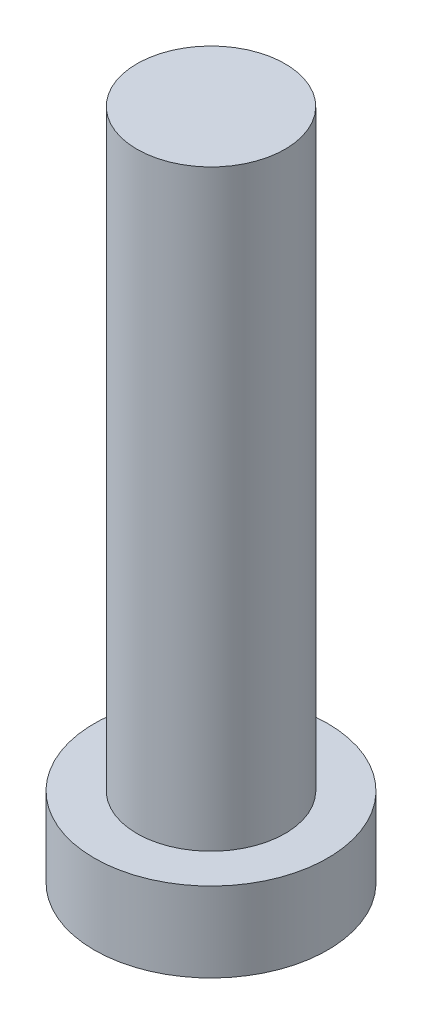
ISO-10303-21;
HEADER;
FILE_DESCRIPTION(('STEP AP214'),'2;1');
FILE_NAME('part.step','',(''),(''),'','','');
FILE_SCHEMA(('AUTOMOTIVE_DESIGN { 1 0 10303 214 1 1 1 1 }'));
ENDSEC;
DATA;
#1=APPLICATION_CONTEXT('core data for automotive mechanical design processes');
#2=APPLICATION_PROTOCOL_DEFINITION('international standard','automotive_design',2000,#1);
#3=PRODUCT_CONTEXT('',#1,'mechanical');
#4=PRODUCT('Part','Part','',(#3));
#5=PRODUCT_RELATED_PRODUCT_CATEGORY('part','',(#4));
#6=PRODUCT_DEFINITION_FORMATION('','',#4);
#7=PRODUCT_DEFINITION_CONTEXT('part definition',#1,'design');
#8=PRODUCT_DEFINITION('design','',#6,#7);
#9=PRODUCT_DEFINITION_SHAPE('','',#8);
#10=(LENGTH_UNIT() NAMED_UNIT(*) SI_UNIT(.MILLI.,.METRE.));
#11=(NAMED_UNIT(*) PLANE_ANGLE_UNIT() SI_UNIT($,.RADIAN.));
#12=(NAMED_UNIT(*) SI_UNIT($,.STERADIAN.) SOLID_ANGLE_UNIT());
#13=UNCERTAINTY_MEASURE_WITH_UNIT(LENGTH_MEASURE(1.E-05),#10,'distance_accuracy_value','');
#14=(GEOMETRIC_REPRESENTATION_CONTEXT(3) GLOBAL_UNCERTAINTY_ASSIGNED_CONTEXT((#13)) GLOBAL_UNIT_ASSIGNED_CONTEXT((#10,
#11,#12)) REPRESENTATION_CONTEXT('',''));
#15=CARTESIAN_POINT('',(0.,0.,0.));
#16=DIRECTION('',(0.,0.,1.));
#17=DIRECTION('',(1.,0.,0.));
#18=AXIS2_PLACEMENT_3D('',#15,#16,#17);
#19=CARTESIAN_POINT('',(0.,0.,0.));
#20=DIRECTION('',(0.,1.,0.));
#21=DIRECTION('',(0.,0.,1.));
#22=AXIS2_PLACEMENT_3D('',#19,#20,#21);
#23=PLANE('',#22);
#24=CARTESIAN_POINT('',(0.,0.,0.));
#25=DIRECTION('',(0.,1.,0.));
#26=DIRECTION('',(0.,0.,1.));
#27=AXIS2_PLACEMENT_3D('',#24,#25,#26);
#28=CIRCLE('',#27,3.15);
#29=CARTESIAN_POINT('',(0.,0.,3.15));
#30=VERTEX_POINT('',#29);
#31=EDGE_CURVE('E39',#30,#30,#28,.T.);
#32=ORIENTED_EDGE('',*,*,#31,.F.);
#33=EDGE_LOOP('',(#32));
#34=FACE_BOUND('',#33,.T.);
#35=CARTESIAN_POINT('',(1.,0.,1.));
#36=DIRECTION('',(0.,1.,0.));
#37=DIRECTION('',(0.,0.,-1.));
#38=AXIS2_PLACEMENT_3D('',#35,#36,#37);
#39=CIRCLE('',#38,0.5);
#40=CARTESIAN_POINT('',(1.,0.,0.5));
#41=VERTEX_POINT('',#40);
#42=CARTESIAN_POINT('',(0.5,0.,1.));
#43=VERTEX_POINT('',#42);
#44=EDGE_CURVE('E186',#41,#43,#39,.T.);
#45=ORIENTED_EDGE('',*,*,#44,.F.);
#46=DIRECTION('',(-1.,0.,0.));
#47=VECTOR('',#46,1.);
#48=CARTESIAN_POINT('',(1.,0.,0.5));
#49=LINE('',#48,#47);
#50=CARTESIAN_POINT('',(2.,0.,0.5));
#51=VERTEX_POINT('',#50);
#52=EDGE_CURVE('E52',#51,#41,#49,.T.);
#53=ORIENTED_EDGE('',*,*,#52,.F.);
#54=DIRECTION('',(0.,0.,1.));
#55=VECTOR('',#54,1.);
#56=CARTESIAN_POINT('',(2.,0.,-0.5));
#57=LINE('',#56,#55);
#58=CARTESIAN_POINT('',(2.,0.,-0.5));
#59=VERTEX_POINT('',#58);
#60=EDGE_CURVE('E225',#59,#51,#57,.T.);
#61=ORIENTED_EDGE('',*,*,#60,.F.);
#62=DIRECTION('',(1.,0.,0.));
#63=VECTOR('',#62,1.);
#64=CARTESIAN_POINT('',(1.,0.,-0.5));
#65=LINE('',#64,#63);
#66=CARTESIAN_POINT('',(1.,0.,-0.5));
#67=VERTEX_POINT('',#66);
#68=EDGE_CURVE('E223',#67,#59,#65,.T.);
#69=ORIENTED_EDGE('',*,*,#68,.F.);
#70=CARTESIAN_POINT('',(1.,0.,-1.));
#71=DIRECTION('',(0.,1.,0.));
#72=DIRECTION('',(0.,0.,-1.));
#73=AXIS2_PLACEMENT_3D('',#70,#71,#72);
#74=CIRCLE('',#73,0.5);
#75=CARTESIAN_POINT('',(0.500000000000001,0.,-1.));
#76=VERTEX_POINT('',#75);
#77=EDGE_CURVE('E160',#76,#67,#74,.T.);
#78=ORIENTED_EDGE('',*,*,#77,.F.);
#79=DIRECTION('',(0.,0.,1.));
#80=VECTOR('',#79,1.);
#81=CARTESIAN_POINT('',(0.500000000000001,0.,-2.));
#82=LINE('',#81,#80);
#83=CARTESIAN_POINT('',(0.500000000000001,0.,-2.));
#84=VERTEX_POINT('',#83);
#85=EDGE_CURVE('E219',#84,#76,#82,.T.);
#86=ORIENTED_EDGE('',*,*,#85,.F.);
#87=DIRECTION('',(1.,0.,0.));
#88=VECTOR('',#87,1.);
#89=CARTESIAN_POINT('',(-0.5,0.,-2.));
#90=LINE('',#89,#88);
#91=CARTESIAN_POINT('',(-0.5,0.,-2.));
#92=VERTEX_POINT('',#91);
#93=EDGE_CURVE('E216',#92,#84,#90,.T.);
#94=ORIENTED_EDGE('',*,*,#93,.F.);
#95=DIRECTION('',(0.,0.,-1.));
#96=VECTOR('',#95,1.);
#97=CARTESIAN_POINT('',(-0.5,0.,-2.));
#98=LINE('',#97,#96);
#99=CARTESIAN_POINT('',(-0.5,0.,-1.));
#100=VERTEX_POINT('',#99);
#101=EDGE_CURVE('E213',#100,#92,#98,.T.);
#102=ORIENTED_EDGE('',*,*,#101,.F.);
#103=CARTESIAN_POINT('',(-1.,0.,-1.));
#104=DIRECTION('',(0.,1.,0.));
#105=DIRECTION('',(0.,0.,-1.));
#106=AXIS2_PLACEMENT_3D('',#103,#104,#105);
#107=CIRCLE('',#106,0.5);
#108=CARTESIAN_POINT('',(-1.,0.,-0.5));
#109=VERTEX_POINT('',#108);
#110=EDGE_CURVE('E210',#109,#100,#107,.T.);
#111=ORIENTED_EDGE('',*,*,#110,.F.);
#112=DIRECTION('',(1.,0.,0.));
#113=VECTOR('',#112,1.);
#114=CARTESIAN_POINT('',(-2.,0.,-0.5));
#115=LINE('',#114,#113);
#116=CARTESIAN_POINT('',(-2.,0.,-0.5));
#117=VERTEX_POINT('',#116);
#118=EDGE_CURVE('E207',#117,#109,#115,.T.);
#119=ORIENTED_EDGE('',*,*,#118,.F.);
#120=DIRECTION('',(0.,0.,-1.));
#121=VECTOR('',#120,1.);
#122=CARTESIAN_POINT('',(-2.,0.,-0.5));
#123=LINE('',#122,#121);
#124=CARTESIAN_POINT('',(-2.,0.,0.5));
#125=VERTEX_POINT('',#124);
#126=EDGE_CURVE('E204',#125,#117,#123,.T.);
#127=ORIENTED_EDGE('',*,*,#126,.F.);
#128=DIRECTION('',(-1.,0.,0.));
#129=VECTOR('',#128,1.);
#130=CARTESIAN_POINT('',(-2.,0.,0.5));
#131=LINE('',#130,#129);
#132=CARTESIAN_POINT('',(-1.,0.,0.5));
#133=VERTEX_POINT('',#132);
#134=EDGE_CURVE('E201',#133,#125,#131,.T.);
#135=ORIENTED_EDGE('',*,*,#134,.F.);
#136=CARTESIAN_POINT('',(-1.,0.,1.));
#137=DIRECTION('',(0.,1.,0.));
#138=DIRECTION('',(0.,0.,1.));
#139=AXIS2_PLACEMENT_3D('',#136,#137,#138);
#140=CIRCLE('',#139,0.5);
#141=CARTESIAN_POINT('',(-0.5,0.,1.));
#142=VERTEX_POINT('',#141);
#143=EDGE_CURVE('E198',#142,#133,#140,.T.);
#144=ORIENTED_EDGE('',*,*,#143,.F.);
#145=DIRECTION('',(0.,0.,-1.));
#146=VECTOR('',#145,1.);
#147=CARTESIAN_POINT('',(-0.5,0.,1.));
#148=LINE('',#147,#146);
#149=CARTESIAN_POINT('',(-0.5,0.,2.));
#150=VERTEX_POINT('',#149);
#151=EDGE_CURVE('E195',#150,#142,#148,.T.);
#152=ORIENTED_EDGE('',*,*,#151,.F.);
#153=DIRECTION('',(-1.,0.,0.));
#154=VECTOR('',#153,1.);
#155=CARTESIAN_POINT('',(-0.5,0.,2.));
#156=LINE('',#155,#154);
#157=CARTESIAN_POINT('',(0.500000000000001,0.,2.));
#158=VERTEX_POINT('',#157);
#159=EDGE_CURVE('E192',#158,#150,#156,.T.);
#160=ORIENTED_EDGE('',*,*,#159,.F.);
#161=DIRECTION('',(0.,0.,1.));
#162=VECTOR('',#161,1.);
#163=CARTESIAN_POINT('',(0.5,0.,1.));
#164=LINE('',#163,#162);
#165=EDGE_CURVE('E189',#43,#158,#164,.T.);
#166=ORIENTED_EDGE('',*,*,#165,.F.);
#167=EDGE_LOOP('',(#45,#53,#61,#69,#78,#86,#94,#102,#111,#119,#127,#135,#144,#152,#160,#166));
#168=FACE_BOUND('',#167,.T.);
#169=ADVANCED_FACE('F35',(#34,#168),#23,.F.);
#170=CARTESIAN_POINT('',(0.,2.15,0.));
#171=DIRECTION('',(0.,-1.,0.));
#172=DIRECTION('',(0.,0.,-1.));
#173=AXIS2_PLACEMENT_3D('',#170,#171,#172);
#174=CYLINDRICAL_SURFACE('',#173,3.15);
#175=CARTESIAN_POINT('',(0.,2.15,0.));
#176=DIRECTION('',(0.,1.,0.));
#177=DIRECTION('',(0.,0.,1.));
#178=AXIS2_PLACEMENT_3D('',#175,#176,#177);
#179=CIRCLE('',#178,3.15);
#180=CARTESIAN_POINT('',(0.,2.15,3.15));
#181=VERTEX_POINT('',#180);
#182=EDGE_CURVE('E44',#181,#181,#179,.T.);
#183=ORIENTED_EDGE('',*,*,#182,.F.);
#184=EDGE_LOOP('',(#183));
#185=FACE_BOUND('',#184,.T.);
#186=ORIENTED_EDGE('',*,*,#31,.T.);
#187=EDGE_LOOP('',(#186));
#188=FACE_BOUND('',#187,.T.);
#189=ADVANCED_FACE('F37',(#185,#188),#174,.T.);
#190=CARTESIAN_POINT('',(0.,2.15,0.));
#191=DIRECTION('',(0.,1.,0.));
#192=DIRECTION('',(0.,0.,1.));
#193=AXIS2_PLACEMENT_3D('',#190,#191,#192);
#194=PLANE('',#193);
#195=CARTESIAN_POINT('',(0.,2.15,0.));
#196=DIRECTION('',(0.,1.,0.));
#197=DIRECTION('',(0.,0.,1.));
#198=AXIS2_PLACEMENT_3D('',#195,#196,#197);
#199=CIRCLE('',#198,2.);
#200=CARTESIAN_POINT('',(0.,2.15,2.));
#201=VERTEX_POINT('',#200);
#202=EDGE_CURVE('E11',#201,#201,#199,.T.);
#203=ORIENTED_EDGE('',*,*,#202,.F.);
#204=EDGE_LOOP('',(#203));
#205=FACE_BOUND('',#204,.T.);
#206=ORIENTED_EDGE('',*,*,#182,.T.);
#207=EDGE_LOOP('',(#206));
#208=FACE_BOUND('',#207,.T.);
#209=ADVANCED_FACE('F374',(#205,#208),#194,.T.);
#210=CARTESIAN_POINT('',(0.,18.15,0.));
#211=DIRECTION('',(0.,-1.,0.));
#212=DIRECTION('',(0.,0.,-1.));
#213=AXIS2_PLACEMENT_3D('',#210,#211,#212);
#214=CYLINDRICAL_SURFACE('',#213,2.);
#215=CARTESIAN_POINT('',(0.,18.15,0.));
#216=DIRECTION('',(0.,1.,0.));
#217=DIRECTION('',(0.,0.,1.));
#218=AXIS2_PLACEMENT_3D('',#215,#216,#217);
#219=CIRCLE('',#218,2.);
#220=CARTESIAN_POINT('',(0.,18.15,2.));
#221=VERTEX_POINT('',#220);
#222=EDGE_CURVE('E229',#221,#221,#219,.T.);
#223=ORIENTED_EDGE('',*,*,#222,.F.);
#224=EDGE_LOOP('',(#223));
#225=FACE_BOUND('',#224,.T.);
#226=ORIENTED_EDGE('',*,*,#202,.T.);
#227=EDGE_LOOP('',(#226));
#228=FACE_BOUND('',#227,.T.);
#229=ADVANCED_FACE('F370',(#225,#228),#214,.T.);
#230=CARTESIAN_POINT('',(0.,18.15,0.));
#231=DIRECTION('',(0.,1.,0.));
#232=DIRECTION('',(0.,0.,1.));
#233=AXIS2_PLACEMENT_3D('',#230,#231,#232);
#234=PLANE('',#233);
#235=ORIENTED_EDGE('',*,*,#222,.T.);
#236=EDGE_LOOP('',(#235));
#237=FACE_BOUND('',#236,.T.);
#238=ADVANCED_FACE('F320',(#237),#234,.T.);
#239=CARTESIAN_POINT('',(1.,1.5,0.5));
#240=DIRECTION('',(0.,0.,1.));
#241=DIRECTION('',(1.,0.,0.));
#242=AXIS2_PLACEMENT_3D('',#239,#240,#241);
#243=PLANE('',#242);
#244=ORIENTED_EDGE('',*,*,#52,.T.);
#245=DIRECTION('',(0.,-1.,0.));
#246=VECTOR('',#245,1.);
#247=CARTESIAN_POINT('',(1.,1.5,0.5));
#248=LINE('',#247,#246);
#249=CARTESIAN_POINT('',(1.,1.5,0.5));
#250=VERTEX_POINT('',#249);
#251=EDGE_CURVE('E112',#250,#41,#248,.T.);
#252=ORIENTED_EDGE('',*,*,#251,.F.);
#253=DIRECTION('',(-1.,0.,0.));
#254=VECTOR('',#253,1.);
#255=CARTESIAN_POINT('',(1.,1.5,0.5));
#256=LINE('',#255,#254);
#257=CARTESIAN_POINT('',(2.,1.5,0.5));
#258=VERTEX_POINT('',#257);
#259=EDGE_CURVE('E227',#258,#250,#256,.T.);
#260=ORIENTED_EDGE('',*,*,#259,.F.);
#261=DIRECTION('',(0.,-1.,0.));
#262=VECTOR('',#261,1.);
#263=CARTESIAN_POINT('',(2.,1.5,0.5));
#264=LINE('',#263,#262);
#265=EDGE_CURVE('E60',#258,#51,#264,.T.);
#266=ORIENTED_EDGE('',*,*,#265,.T.);
#267=EDGE_LOOP('',(#244,#252,#260,#266));
#268=FACE_BOUND('',#267,.T.);
#269=ADVANCED_FACE('F313',(#268),#243,.F.);
#270=CARTESIAN_POINT('',(2.,1.5,-0.5));
#271=DIRECTION('',(1.,0.,0.));
#272=DIRECTION('',(0.,0.,-1.));
#273=AXIS2_PLACEMENT_3D('',#270,#271,#272);
#274=PLANE('',#273);
#275=ORIENTED_EDGE('',*,*,#60,.T.);
#276=ORIENTED_EDGE('',*,*,#265,.F.);
#277=DIRECTION('',(0.,0.,1.));
#278=VECTOR('',#277,1.);
#279=CARTESIAN_POINT('',(2.,1.5,-0.5));
#280=LINE('',#279,#278);
#281=CARTESIAN_POINT('',(2.,1.5,-0.5));
#282=VERTEX_POINT('',#281);
#283=EDGE_CURVE('E172',#282,#258,#280,.T.);
#284=ORIENTED_EDGE('',*,*,#283,.F.);
#285=DIRECTION('',(0.,-1.,0.));
#286=VECTOR('',#285,1.);
#287=CARTESIAN_POINT('',(2.,1.5,-0.5));
#288=LINE('',#287,#286);
#289=EDGE_CURVE('E164',#282,#59,#288,.T.);
#290=ORIENTED_EDGE('',*,*,#289,.T.);
#291=EDGE_LOOP('',(#275,#276,#284,#290));
#292=FACE_BOUND('',#291,.T.);
#293=ADVANCED_FACE('F311',(#292),#274,.F.);
#294=CARTESIAN_POINT('',(1.,1.5,-0.5));
#295=DIRECTION('',(0.,0.,-1.));
#296=DIRECTION('',(-1.,0.,0.));
#297=AXIS2_PLACEMENT_3D('',#294,#295,#296);
#298=PLANE('',#297);
#299=ORIENTED_EDGE('',*,*,#68,.T.);
#300=ORIENTED_EDGE('',*,*,#289,.F.);
#301=DIRECTION('',(1.,0.,0.));
#302=VECTOR('',#301,1.);
#303=CARTESIAN_POINT('',(1.,1.5,-0.5));
#304=LINE('',#303,#302);
#305=CARTESIAN_POINT('',(1.,1.5,-0.5));
#306=VERTEX_POINT('',#305);
#307=EDGE_CURVE('E168',#306,#282,#304,.T.);
#308=ORIENTED_EDGE('',*,*,#307,.F.);
#309=DIRECTION('',(0.,-1.,0.));
#310=VECTOR('',#309,1.);
#311=CARTESIAN_POINT('',(1.,1.5,-0.5));
#312=LINE('',#311,#310);
#313=EDGE_CURVE('E153',#306,#67,#312,.T.);
#314=ORIENTED_EDGE('',*,*,#313,.T.);
#315=EDGE_LOOP('',(#299,#300,#308,#314));
#316=FACE_BOUND('',#315,.T.);
#317=ADVANCED_FACE('F169',(#316),#298,.F.);
#318=CARTESIAN_POINT('',(1.,1.5,-1.));
#319=DIRECTION('',(0.,-1.,0.));
#320=DIRECTION('',(0.,0.,-1.));
#321=AXIS2_PLACEMENT_3D('',#318,#319,#320);
#322=CYLINDRICAL_SURFACE('',#321,0.5);
#323=ORIENTED_EDGE('',*,*,#77,.T.);
#324=ORIENTED_EDGE('',*,*,#313,.F.);
#325=CARTESIAN_POINT('',(1.,1.5,-1.));
#326=DIRECTION('',(0.,1.,0.));
#327=DIRECTION('',(0.,0.,-1.));
#328=AXIS2_PLACEMENT_3D('',#325,#326,#327);
#329=CIRCLE('',#328,0.5);
#330=CARTESIAN_POINT('',(0.500000000000001,1.5,-1.));
#331=VERTEX_POINT('',#330);
#332=EDGE_CURVE('E157',#331,#306,#329,.T.);
#333=ORIENTED_EDGE('',*,*,#332,.F.);
#334=DIRECTION('',(0.,-1.,0.));
#335=VECTOR('',#334,1.);
#336=CARTESIAN_POINT('',(0.500000000000001,1.5,-1.));
#337=LINE('',#336,#335);
#338=EDGE_CURVE('E165',#331,#76,#337,.T.);
#339=ORIENTED_EDGE('',*,*,#338,.T.);
#340=EDGE_LOOP('',(#323,#324,#333,#339));
#341=FACE_BOUND('',#340,.T.);
#342=ADVANCED_FACE('F155',(#341),#322,.T.);
#343=CARTESIAN_POINT('',(0.500000000000001,1.5,-2.));
#344=DIRECTION('',(1.,0.,0.));
#345=DIRECTION('',(0.,0.,-1.));
#346=AXIS2_PLACEMENT_3D('',#343,#344,#345);
#347=PLANE('',#346);
#348=ORIENTED_EDGE('',*,*,#85,.T.);
#349=ORIENTED_EDGE('',*,*,#338,.F.);
#350=DIRECTION('',(0.,0.,1.));
#351=VECTOR('',#350,1.);
#352=CARTESIAN_POINT('',(0.500000000000001,1.5,-2.));
#353=LINE('',#352,#351);
#354=CARTESIAN_POINT('',(0.500000000000001,1.5,-2.));
#355=VERTEX_POINT('',#354);
#356=EDGE_CURVE('E178',#355,#331,#353,.T.);
#357=ORIENTED_EDGE('',*,*,#356,.F.);
#358=DIRECTION('',(0.,-1.,0.));
#359=VECTOR('',#358,1.);
#360=CARTESIAN_POINT('',(0.500000000000001,1.5,-2.));
#361=LINE('',#360,#359);
#362=EDGE_CURVE('E232',#355,#84,#361,.T.);
#363=ORIENTED_EDGE('',*,*,#362,.T.);
#364=EDGE_LOOP('',(#348,#349,#357,#363));
#365=FACE_BOUND('',#364,.T.);
#366=ADVANCED_FACE('F310',(#365),#347,.F.);
#367=CARTESIAN_POINT('',(-0.5,1.5,-2.));
#368=DIRECTION('',(0.,0.,-1.));
#369=DIRECTION('',(-1.,0.,0.));
#370=AXIS2_PLACEMENT_3D('',#367,#368,#369);
#371=PLANE('',#370);
#372=ORIENTED_EDGE('',*,*,#93,.T.);
#373=ORIENTED_EDGE('',*,*,#362,.F.);
#374=DIRECTION('',(1.,0.,0.));
#375=VECTOR('',#374,1.);
#376=CARTESIAN_POINT('',(-0.5,1.5,-2.));
#377=LINE('',#376,#375);
#378=CARTESIAN_POINT('',(-0.5,1.5,-2.));
#379=VERTEX_POINT('',#378);
#380=EDGE_CURVE('E180',#379,#355,#377,.T.);
#381=ORIENTED_EDGE('',*,*,#380,.F.);
#382=DIRECTION('',(0.,-1.,0.));
#383=VECTOR('',#382,1.);
#384=CARTESIAN_POINT('',(-0.5,1.5,-2.));
#385=LINE('',#384,#383);
#386=EDGE_CURVE('E234',#379,#92,#385,.T.);
#387=ORIENTED_EDGE('',*,*,#386,.T.);
#388=EDGE_LOOP('',(#372,#373,#381,#387));
#389=FACE_BOUND('',#388,.T.);
#390=ADVANCED_FACE('F306',(#389),#371,.F.);
#391=CARTESIAN_POINT('',(-0.5,1.5,-2.));
#392=DIRECTION('',(-1.,0.,0.));
#393=DIRECTION('',(0.,0.,1.));
#394=AXIS2_PLACEMENT_3D('',#391,#392,#393);
#395=PLANE('',#394);
#396=ORIENTED_EDGE('',*,*,#101,.T.);
#397=ORIENTED_EDGE('',*,*,#386,.F.);
#398=DIRECTION('',(0.,0.,-1.));
#399=VECTOR('',#398,1.);
#400=CARTESIAN_POINT('',(-0.5,1.5,-2.));
#401=LINE('',#400,#399);
#402=CARTESIAN_POINT('',(-0.5,1.5,-1.));
#403=VERTEX_POINT('',#402);
#404=EDGE_CURVE('E301',#403,#379,#401,.T.);
#405=ORIENTED_EDGE('',*,*,#404,.F.);
#406=DIRECTION('',(0.,-1.,0.));
#407=VECTOR('',#406,1.);
#408=CARTESIAN_POINT('',(-0.5,1.5,-1.));
#409=LINE('',#408,#407);
#410=EDGE_CURVE('E236',#403,#100,#409,.T.);
#411=ORIENTED_EDGE('',*,*,#410,.T.);
#412=EDGE_LOOP('',(#396,#397,#405,#411));
#413=FACE_BOUND('',#412,.T.);
#414=ADVANCED_FACE('F330',(#413),#395,.F.);
#415=CARTESIAN_POINT('',(-1.,1.5,-1.));
#416=DIRECTION('',(0.,-1.,0.));
#417=DIRECTION('',(0.,0.,-1.));
#418=AXIS2_PLACEMENT_3D('',#415,#416,#417);
#419=CYLINDRICAL_SURFACE('',#418,0.5);
#420=ORIENTED_EDGE('',*,*,#110,.T.);
#421=ORIENTED_EDGE('',*,*,#410,.F.);
#422=CARTESIAN_POINT('',(-1.,1.5,-1.));
#423=DIRECTION('',(0.,1.,0.));
#424=DIRECTION('',(0.,0.,-1.));
#425=AXIS2_PLACEMENT_3D('',#422,#423,#424);
#426=CIRCLE('',#425,0.5);
#427=CARTESIAN_POINT('',(-1.,1.5,-0.5));
#428=VERTEX_POINT('',#427);
#429=EDGE_CURVE('E298',#428,#403,#426,.T.);
#430=ORIENTED_EDGE('',*,*,#429,.F.);
#431=DIRECTION('',(0.,-1.,0.));
#432=VECTOR('',#431,1.);
#433=CARTESIAN_POINT('',(-1.,1.5,-0.5));
#434=LINE('',#433,#432);
#435=EDGE_CURVE('E238',#428,#109,#434,.T.);
#436=ORIENTED_EDGE('',*,*,#435,.T.);
#437=EDGE_LOOP('',(#420,#421,#430,#436));
#438=FACE_BOUND('',#437,.T.);
#439=ADVANCED_FACE('F333',(#438),#419,.T.);
#440=CARTESIAN_POINT('',(-2.,1.5,-0.5));
#441=DIRECTION('',(0.,0.,-1.));
#442=DIRECTION('',(-1.,0.,0.));
#443=AXIS2_PLACEMENT_3D('',#440,#441,#442);
#444=PLANE('',#443);
#445=ORIENTED_EDGE('',*,*,#118,.T.);
#446=ORIENTED_EDGE('',*,*,#435,.F.);
#447=DIRECTION('',(1.,0.,0.));
#448=VECTOR('',#447,1.);
#449=CARTESIAN_POINT('',(-2.,1.5,-0.5));
#450=LINE('',#449,#448);
#451=CARTESIAN_POINT('',(-2.,1.5,-0.5));
#452=VERTEX_POINT('',#451);
#453=EDGE_CURVE('E295',#452,#428,#450,.T.);
#454=ORIENTED_EDGE('',*,*,#453,.F.);
#455=DIRECTION('',(0.,-1.,0.));
#456=VECTOR('',#455,1.);
#457=CARTESIAN_POINT('',(-2.,1.5,-0.5));
#458=LINE('',#457,#456);
#459=EDGE_CURVE('E240',#452,#117,#458,.T.);
#460=ORIENTED_EDGE('',*,*,#459,.T.);
#461=EDGE_LOOP('',(#445,#446,#454,#460));
#462=FACE_BOUND('',#461,.T.);
#463=ADVANCED_FACE('F337',(#462),#444,.F.);
#464=CARTESIAN_POINT('',(-2.,1.5,-0.5));
#465=DIRECTION('',(-1.,0.,0.));
#466=DIRECTION('',(0.,0.,1.));
#467=AXIS2_PLACEMENT_3D('',#464,#465,#466);
#468=PLANE('',#467);
#469=ORIENTED_EDGE('',*,*,#126,.T.);
#470=ORIENTED_EDGE('',*,*,#459,.F.);
#471=DIRECTION('',(0.,0.,-1.));
#472=VECTOR('',#471,1.);
#473=CARTESIAN_POINT('',(-2.,1.5,-0.5));
#474=LINE('',#473,#472);
#475=CARTESIAN_POINT('',(-2.,1.5,0.5));
#476=VERTEX_POINT('',#475);
#477=EDGE_CURVE('E292',#476,#452,#474,.T.);
#478=ORIENTED_EDGE('',*,*,#477,.F.);
#479=DIRECTION('',(0.,-1.,0.));
#480=VECTOR('',#479,1.);
#481=CARTESIAN_POINT('',(-2.,1.5,0.5));
#482=LINE('',#481,#480);
#483=EDGE_CURVE('E242',#476,#125,#482,.T.);
#484=ORIENTED_EDGE('',*,*,#483,.T.);
#485=EDGE_LOOP('',(#469,#470,#478,#484));
#486=FACE_BOUND('',#485,.T.);
#487=ADVANCED_FACE('F341',(#486),#468,.F.);
#488=CARTESIAN_POINT('',(-2.,1.5,0.5));
#489=DIRECTION('',(0.,0.,1.));
#490=DIRECTION('',(1.,0.,0.));
#491=AXIS2_PLACEMENT_3D('',#488,#489,#490);
#492=PLANE('',#491);
#493=ORIENTED_EDGE('',*,*,#134,.T.);
#494=ORIENTED_EDGE('',*,*,#483,.F.);
#495=DIRECTION('',(-1.,0.,0.));
#496=VECTOR('',#495,1.);
#497=CARTESIAN_POINT('',(-2.,1.5,0.5));
#498=LINE('',#497,#496);
#499=CARTESIAN_POINT('',(-1.,1.5,0.5));
#500=VERTEX_POINT('',#499);
#501=EDGE_CURVE('E289',#500,#476,#498,.T.);
#502=ORIENTED_EDGE('',*,*,#501,.F.);
#503=DIRECTION('',(0.,-1.,0.));
#504=VECTOR('',#503,1.);
#505=CARTESIAN_POINT('',(-1.,1.5,0.5));
#506=LINE('',#505,#504);
#507=EDGE_CURVE('E244',#500,#133,#506,.T.);
#508=ORIENTED_EDGE('',*,*,#507,.T.);
#509=EDGE_LOOP('',(#493,#494,#502,#508));
#510=FACE_BOUND('',#509,.T.);
#511=ADVANCED_FACE('F345',(#510),#492,.F.);
#512=CARTESIAN_POINT('',(-1.,1.5,1.));
#513=DIRECTION('',(0.,-1.,0.));
#514=DIRECTION('',(0.,0.,-1.));
#515=AXIS2_PLACEMENT_3D('',#512,#513,#514);
#516=CYLINDRICAL_SURFACE('',#515,0.5);
#517=ORIENTED_EDGE('',*,*,#143,.T.);
#518=ORIENTED_EDGE('',*,*,#507,.F.);
#519=CARTESIAN_POINT('',(-1.,1.5,1.));
#520=DIRECTION('',(0.,1.,0.));
#521=DIRECTION('',(0.,0.,1.));
#522=AXIS2_PLACEMENT_3D('',#519,#520,#521);
#523=CIRCLE('',#522,0.5);
#524=CARTESIAN_POINT('',(-0.5,1.5,1.));
#525=VERTEX_POINT('',#524);
#526=EDGE_CURVE('E286',#525,#500,#523,.T.);
#527=ORIENTED_EDGE('',*,*,#526,.F.);
#528=DIRECTION('',(0.,-1.,0.));
#529=VECTOR('',#528,1.);
#530=CARTESIAN_POINT('',(-0.5,1.5,1.));
#531=LINE('',#530,#529);
#532=EDGE_CURVE('E246',#525,#142,#531,.T.);
#533=ORIENTED_EDGE('',*,*,#532,.T.);
#534=EDGE_LOOP('',(#517,#518,#527,#533));
#535=FACE_BOUND('',#534,.T.);
#536=ADVANCED_FACE('F349',(#535),#516,.T.);
#537=CARTESIAN_POINT('',(-0.5,1.5,1.));
#538=DIRECTION('',(-1.,0.,0.));
#539=DIRECTION('',(0.,0.,1.));
#540=AXIS2_PLACEMENT_3D('',#537,#538,#539);
#541=PLANE('',#540);
#542=ORIENTED_EDGE('',*,*,#151,.T.);
#543=ORIENTED_EDGE('',*,*,#532,.F.);
#544=DIRECTION('',(0.,0.,-1.));
#545=VECTOR('',#544,1.);
#546=CARTESIAN_POINT('',(-0.5,1.5,1.));
#547=LINE('',#546,#545);
#548=CARTESIAN_POINT('',(-0.5,1.5,2.));
#549=VERTEX_POINT('',#548);
#550=EDGE_CURVE('E283',#549,#525,#547,.T.);
#551=ORIENTED_EDGE('',*,*,#550,.F.);
#552=DIRECTION('',(0.,-1.,0.));
#553=VECTOR('',#552,1.);
#554=CARTESIAN_POINT('',(-0.5,1.5,2.));
#555=LINE('',#554,#553);
#556=EDGE_CURVE('E248',#549,#150,#555,.T.);
#557=ORIENTED_EDGE('',*,*,#556,.T.);
#558=EDGE_LOOP('',(#542,#543,#551,#557));
#559=FACE_BOUND('',#558,.T.);
#560=ADVANCED_FACE('F353',(#559),#541,.F.);
#561=CARTESIAN_POINT('',(-0.5,1.5,2.));
#562=DIRECTION('',(0.,0.,1.));
#563=DIRECTION('',(1.,0.,0.));
#564=AXIS2_PLACEMENT_3D('',#561,#562,#563);
#565=PLANE('',#564);
#566=ORIENTED_EDGE('',*,*,#159,.T.);
#567=ORIENTED_EDGE('',*,*,#556,.F.);
#568=DIRECTION('',(-1.,0.,0.));
#569=VECTOR('',#568,1.);
#570=CARTESIAN_POINT('',(-0.5,1.5,2.));
#571=LINE('',#570,#569);
#572=CARTESIAN_POINT('',(0.500000000000001,1.5,2.));
#573=VERTEX_POINT('',#572);
#574=EDGE_CURVE('E280',#573,#549,#571,.T.);
#575=ORIENTED_EDGE('',*,*,#574,.F.);
#576=DIRECTION('',(0.,-1.,0.));
#577=VECTOR('',#576,1.);
#578=CARTESIAN_POINT('',(0.500000000000001,1.5,2.));
#579=LINE('',#578,#577);
#580=EDGE_CURVE('E250',#573,#158,#579,.T.);
#581=ORIENTED_EDGE('',*,*,#580,.T.);
#582=EDGE_LOOP('',(#566,#567,#575,#581));
#583=FACE_BOUND('',#582,.T.);
#584=ADVANCED_FACE('F357',(#583),#565,.F.);
#585=CARTESIAN_POINT('',(0.5,1.5,1.));
#586=DIRECTION('',(1.,0.,0.));
#587=DIRECTION('',(0.,0.,-1.));
#588=AXIS2_PLACEMENT_3D('',#585,#586,#587);
#589=PLANE('',#588);
#590=ORIENTED_EDGE('',*,*,#165,.T.);
#591=ORIENTED_EDGE('',*,*,#580,.F.);
#592=DIRECTION('',(0.,0.,1.));
#593=VECTOR('',#592,1.);
#594=CARTESIAN_POINT('',(0.5,1.5,1.));
#595=LINE('',#594,#593);
#596=CARTESIAN_POINT('',(0.5,1.5,1.));
#597=VERTEX_POINT('',#596);
#598=EDGE_CURVE('E275',#597,#573,#595,.T.);
#599=ORIENTED_EDGE('',*,*,#598,.F.);
#600=DIRECTION('',(0.,-1.,0.));
#601=VECTOR('',#600,1.);
#602=CARTESIAN_POINT('',(0.5,1.5,1.));
#603=LINE('',#602,#601);
#604=EDGE_CURVE('E252',#597,#43,#603,.T.);
#605=ORIENTED_EDGE('',*,*,#604,.T.);
#606=EDGE_LOOP('',(#590,#591,#599,#605));
#607=FACE_BOUND('',#606,.T.);
#608=ADVANCED_FACE('F361',(#607),#589,.F.);
#609=CARTESIAN_POINT('',(1.,1.5,1.));
#610=DIRECTION('',(0.,-1.,0.));
#611=DIRECTION('',(0.,0.,-1.));
#612=AXIS2_PLACEMENT_3D('',#609,#610,#611);
#613=CYLINDRICAL_SURFACE('',#612,0.5);
#614=ORIENTED_EDGE('',*,*,#44,.T.);
#615=ORIENTED_EDGE('',*,*,#604,.F.);
#616=CARTESIAN_POINT('',(1.,1.5,1.));
#617=DIRECTION('',(0.,1.,0.));
#618=DIRECTION('',(0.,0.,-1.));
#619=AXIS2_PLACEMENT_3D('',#616,#617,#618);
#620=CIRCLE('',#619,0.5);
#621=EDGE_CURVE('E273',#250,#597,#620,.T.);
#622=ORIENTED_EDGE('',*,*,#621,.F.);
#623=ORIENTED_EDGE('',*,*,#251,.T.);
#624=EDGE_LOOP('',(#614,#615,#622,#623));
#625=FACE_BOUND('',#624,.T.);
#626=ADVANCED_FACE('F270',(#625),#613,.T.);
#627=CARTESIAN_POINT('',(1.,1.5,-1.));
#628=DIRECTION('',(0.,-1.,0.));
#629=DIRECTION('',(0.,0.,-1.));
#630=AXIS2_PLACEMENT_3D('',#627,#628,#629);
#631=PLANE('',#630);
#632=ORIENTED_EDGE('',*,*,#259,.T.);
#633=ORIENTED_EDGE('',*,*,#621,.T.);
#634=ORIENTED_EDGE('',*,*,#598,.T.);
#635=ORIENTED_EDGE('',*,*,#574,.T.);
#636=ORIENTED_EDGE('',*,*,#550,.T.);
#637=ORIENTED_EDGE('',*,*,#526,.T.);
#638=ORIENTED_EDGE('',*,*,#501,.T.);
#639=ORIENTED_EDGE('',*,*,#477,.T.);
#640=ORIENTED_EDGE('',*,*,#453,.T.);
#641=ORIENTED_EDGE('',*,*,#429,.T.);
#642=ORIENTED_EDGE('',*,*,#404,.T.);
#643=ORIENTED_EDGE('',*,*,#380,.T.);
#644=ORIENTED_EDGE('',*,*,#356,.T.);
#645=ORIENTED_EDGE('',*,*,#332,.T.);
#646=ORIENTED_EDGE('',*,*,#307,.T.);
#647=ORIENTED_EDGE('',*,*,#283,.T.);
#648=EDGE_LOOP('',(#632,#633,#634,#635,#636,#637,#638,#639,#640,#641,#642,#643,#644,#645,#646,#647));
#649=FACE_BOUND('',#648,.T.);
#650=ADVANCED_FACE('F175',(#649),#631,.T.);
#651=CLOSED_SHELL('',(#169,#189,#209,#229,#238,#269,#293,#317,#342,#366,#390,#414,#439,#463,
#487,#511,#536,#560,#584,#608,#626,#650));
#652=MANIFOLD_SOLID_BREP('B2',#651);
#653=ADVANCED_BREP_SHAPE_REPRESENTATION('',(#18,#652),#14);
#654=SHAPE_DEFINITION_REPRESENTATION(#9,#653);
ENDSEC;
END-ISO-10303-21;
